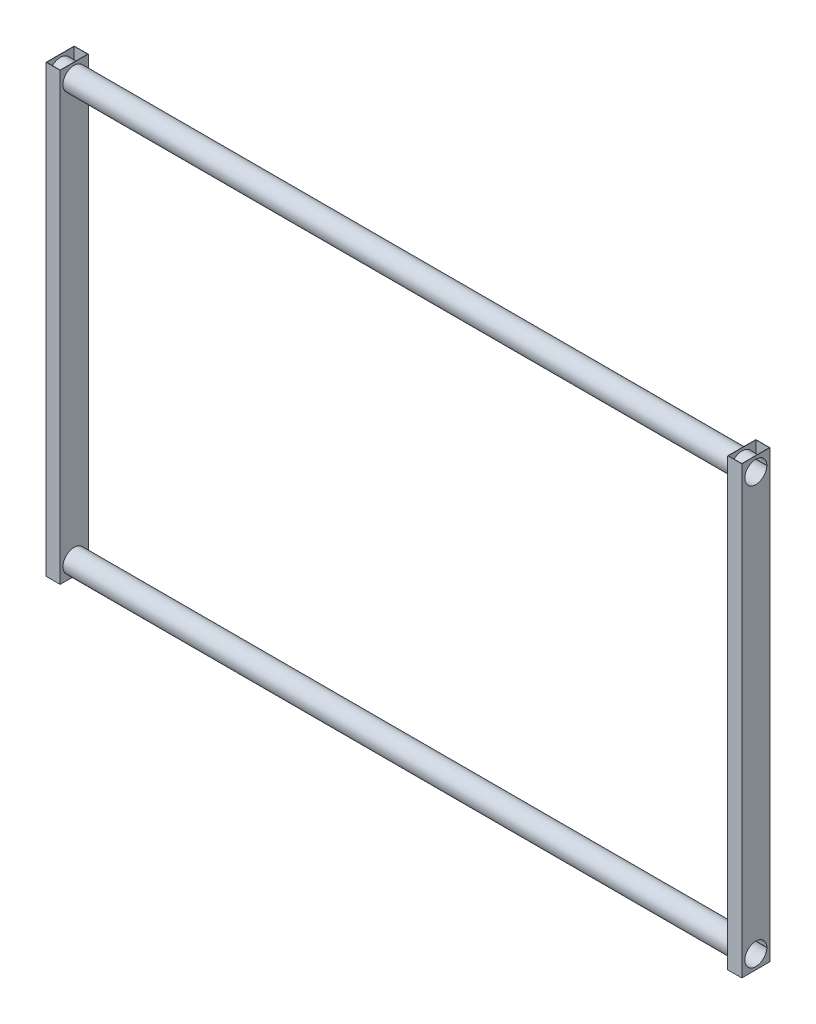
ISO-10303-21;
HEADER;
FILE_DESCRIPTION(('STEP AP214'),'2;1');
FILE_NAME('part.step','',(''),(''),'','','');
FILE_SCHEMA(('AUTOMOTIVE_DESIGN { 1 0 10303 214 1 1 1 1 }'));
ENDSEC;
DATA;
#1=APPLICATION_CONTEXT('core data for automotive mechanical design processes');
#2=APPLICATION_PROTOCOL_DEFINITION('international standard','automotive_design',2000,#1);
#3=PRODUCT_CONTEXT('',#1,'mechanical');
#4=PRODUCT('Part','Part','',(#3));
#5=PRODUCT_RELATED_PRODUCT_CATEGORY('part','',(#4));
#6=PRODUCT_DEFINITION_FORMATION('','',#4);
#7=PRODUCT_DEFINITION_CONTEXT('part definition',#1,'design');
#8=PRODUCT_DEFINITION('design','',#6,#7);
#9=PRODUCT_DEFINITION_SHAPE('','',#8);
#10=(LENGTH_UNIT() NAMED_UNIT(*) SI_UNIT(.MILLI.,.METRE.));
#11=(NAMED_UNIT(*) PLANE_ANGLE_UNIT() SI_UNIT($,.RADIAN.));
#12=(NAMED_UNIT(*) SI_UNIT($,.STERADIAN.) SOLID_ANGLE_UNIT());
#13=UNCERTAINTY_MEASURE_WITH_UNIT(LENGTH_MEASURE(1.E-05),#10,'distance_accuracy_value','');
#14=(GEOMETRIC_REPRESENTATION_CONTEXT(3) GLOBAL_UNCERTAINTY_ASSIGNED_CONTEXT((#13)) GLOBAL_UNIT_ASSIGNED_CONTEXT((#10,
#11,#12)) REPRESENTATION_CONTEXT('',''));
#15=CARTESIAN_POINT('',(0.,0.,0.));
#16=DIRECTION('',(0.,0.,1.));
#17=DIRECTION('',(1.,0.,0.));
#18=AXIS2_PLACEMENT_3D('',#15,#16,#17);
#19=CARTESIAN_POINT('',(2448.5,1600.,-49.5000000000003));
#20=DIRECTION('',(-1.,0.,0.));
#21=DIRECTION('',(0.,0.,1.));
#22=AXIS2_PLACEMENT_3D('',#19,#20,#21);
#23=PLANE('',#22);
#24=DIRECTION('',(0.,0.,-1.));
#25=VECTOR('',#24,1.);
#26=CARTESIAN_POINT('',(2448.5,0.,-49.5000000000003));
#27=LINE('',#26,#25);
#28=CARTESIAN_POINT('',(2448.5,0.,49.5000000000003));
#29=VERTEX_POINT('',#28);
#30=CARTESIAN_POINT('',(2448.5,0.,-49.5000000000003));
#31=VERTEX_POINT('',#30);
#32=EDGE_CURVE('E502',#29,#31,#27,.T.);
#33=ORIENTED_EDGE('',*,*,#32,.F.);
#34=DIRECTION('',(0.,-1.,0.));
#35=VECTOR('',#34,1.);
#36=CARTESIAN_POINT('',(2448.5,1600.,49.5000000000003));
#37=LINE('',#36,#35);
#38=CARTESIAN_POINT('',(2448.5,1600.,49.5000000000003));
#39=VERTEX_POINT('',#38);
#40=EDGE_CURVE('E521',#39,#29,#37,.T.);
#41=ORIENTED_EDGE('',*,*,#40,.F.);
#42=DIRECTION('',(0.,0.,-1.));
#43=VECTOR('',#42,1.);
#44=CARTESIAN_POINT('',(2448.5,1600.,-49.5000000000003));
#45=LINE('',#44,#43);
#46=CARTESIAN_POINT('',(2448.5,1600.,-49.5000000000003));
#47=VERTEX_POINT('',#46);
#48=EDGE_CURVE('E487',#39,#47,#45,.T.);
#49=ORIENTED_EDGE('',*,*,#48,.T.);
#50=DIRECTION('',(0.,-1.,0.));
#51=VECTOR('',#50,1.);
#52=CARTESIAN_POINT('',(2448.5,1600.,-49.5000000000003));
#53=LINE('',#52,#51);
#54=EDGE_CURVE('E518',#47,#31,#53,.T.);
#55=ORIENTED_EDGE('',*,*,#54,.T.);
#56=EDGE_LOOP('',(#33,#41,#49,#55));
#57=FACE_BOUND('',#56,.T.);
#58=CARTESIAN_POINT('',(2448.5,50.,0.));
#59=DIRECTION('',(-1.,0.,0.));
#60=DIRECTION('',(0.,0.,1.));
#61=AXIS2_PLACEMENT_3D('',#58,#59,#60);
#62=CIRCLE('',#61,39.5);
#63=CARTESIAN_POINT('',(2448.5,49.5,-39.496835316263));
#64=VERTEX_POINT('',#63);
#65=CARTESIAN_POINT('',(2448.5,50.5,-39.496835316263));
#66=VERTEX_POINT('',#65);
#67=EDGE_CURVE('E478',#64,#66,#62,.F.);
#68=ORIENTED_EDGE('',*,*,#67,.T.);
#69=DIRECTION('',(0.,0.,1.));
#70=VECTOR('',#69,1.);
#71=CARTESIAN_POINT('',(2448.5,50.5,-39.496835316263));
#72=LINE('',#71,#70);
#73=CARTESIAN_POINT('',(2448.5,50.5,-40.4969134626332));
#74=VERTEX_POINT('',#73);
#75=EDGE_CURVE('E429',#74,#66,#72,.T.);
#76=ORIENTED_EDGE('',*,*,#75,.F.);
#77=CARTESIAN_POINT('',(2448.5,50.,0.));
#78=DIRECTION('',(-1.,0.,0.));
#79=DIRECTION('',(0.,0.,1.));
#80=AXIS2_PLACEMENT_3D('',#77,#78,#79);
#81=CIRCLE('',#80,40.5);
#82=CARTESIAN_POINT('',(2448.5,49.5000000000001,-40.4969134626332));
#83=VERTEX_POINT('',#82);
#84=EDGE_CURVE('E425',#83,#74,#81,.T.);
#85=ORIENTED_EDGE('',*,*,#84,.F.);
#86=DIRECTION('',(0.,0.,-1.));
#87=VECTOR('',#86,1.);
#88=CARTESIAN_POINT('',(2448.5,49.5,-39.496835316263));
#89=LINE('',#88,#87);
#90=EDGE_CURVE('E411',#64,#83,#89,.T.);
#91=ORIENTED_EDGE('',*,*,#90,.F.);
#92=EDGE_LOOP('',(#68,#76,#85,#91));
#93=FACE_BOUND('',#92,.T.);
#94=CARTESIAN_POINT('',(2448.5,1550.,0.));
#95=DIRECTION('',(-1.,0.,0.));
#96=DIRECTION('',(0.,0.,1.));
#97=AXIS2_PLACEMENT_3D('',#94,#95,#96);
#98=CIRCLE('',#97,39.5);
#99=CARTESIAN_POINT('',(2448.5,1549.5,-39.496835316263));
#100=VERTEX_POINT('',#99);
#101=CARTESIAN_POINT('',(2448.5,1550.5,-39.496835316263));
#102=VERTEX_POINT('',#101);
#103=EDGE_CURVE('E250',#100,#102,#98,.F.);
#104=ORIENTED_EDGE('',*,*,#103,.T.);
#105=DIRECTION('',(0.,0.,1.));
#106=VECTOR('',#105,1.);
#107=CARTESIAN_POINT('',(2448.5,1550.5,-40.4969134626332));
#108=LINE('',#107,#106);
#109=CARTESIAN_POINT('',(2448.5,1550.5,-40.4969134626332));
#110=VERTEX_POINT('',#109);
#111=EDGE_CURVE('E56',#110,#102,#108,.T.);
#112=ORIENTED_EDGE('',*,*,#111,.F.);
#113=CARTESIAN_POINT('',(2448.5,1550.,0.));
#114=DIRECTION('',(-1.,0.,0.));
#115=DIRECTION('',(0.,0.,-1.));
#116=AXIS2_PLACEMENT_3D('',#113,#114,#115);
#117=CIRCLE('',#116,40.5);
#118=CARTESIAN_POINT('',(2448.5,1549.5,-40.4969134626332));
#119=VERTEX_POINT('',#118);
#120=EDGE_CURVE('E61',#119,#110,#117,.T.);
#121=ORIENTED_EDGE('',*,*,#120,.F.);
#122=DIRECTION('',(0.,0.,-1.));
#123=VECTOR('',#122,1.);
#124=CARTESIAN_POINT('',(2448.5,1549.5,-40.4969134626332));
#125=LINE('',#124,#123);
#126=EDGE_CURVE('E263',#100,#119,#125,.T.);
#127=ORIENTED_EDGE('',*,*,#126,.F.);
#128=EDGE_LOOP('',(#104,#112,#121,#127));
#129=FACE_BOUND('',#128,.T.);
#130=ADVANCED_FACE('F40',(#57,#93,#129),#23,.T.);
#131=CARTESIAN_POINT('',(-115.55129855222,1550.,0.));
#132=DIRECTION('',(1.,0.,0.));
#133=DIRECTION('',(0.,0.,-1.));
#134=AXIS2_PLACEMENT_3D('',#131,#132,#133);
#135=CYLINDRICAL_SURFACE('',#134,40.5);
#136=DIRECTION('',(1.,0.,0.));
#137=VECTOR('',#136,1.);
#138=CARTESIAN_POINT('',(-164.04911606151,1550.5,-40.4969134626332));
#139=LINE('',#138,#137);
#140=CARTESIAN_POINT('',(2399.,1550.5,-40.4969134626332));
#141=VERTEX_POINT('',#140);
#142=CARTESIAN_POINT('',(2400.,1550.5,-40.4969134626332));
#143=VERTEX_POINT('',#142);
#144=EDGE_CURVE('E610',#141,#143,#139,.T.);
#145=ORIENTED_EDGE('',*,*,#144,.F.);
#146=CARTESIAN_POINT('',(2399.,1550.,0.));
#147=DIRECTION('',(1.,0.,0.));
#148=DIRECTION('',(0.,0.,-1.));
#149=AXIS2_PLACEMENT_3D('',#146,#147,#148);
#150=CIRCLE('',#149,40.5);
#151=CARTESIAN_POINT('',(2399.,1549.5,-40.4969134626332));
#152=VERTEX_POINT('',#151);
#153=EDGE_CURVE('E461',#152,#141,#150,.T.);
#154=ORIENTED_EDGE('',*,*,#153,.F.);
#155=DIRECTION('',(1.,0.,0.));
#156=VECTOR('',#155,1.);
#157=CARTESIAN_POINT('',(-164.04911606151,1549.5,-40.4969134626332));
#158=LINE('',#157,#156);
#159=CARTESIAN_POINT('',(2400.,1549.5,-40.4969134626332));
#160=VERTEX_POINT('',#159);
#161=EDGE_CURVE('E607',#152,#160,#158,.T.);
#162=ORIENTED_EDGE('',*,*,#161,.T.);
#163=CARTESIAN_POINT('',(2400.,1550.,0.));
#164=DIRECTION('',(1.,0.,0.));
#165=DIRECTION('',(0.,0.,-1.));
#166=AXIS2_PLACEMENT_3D('',#163,#164,#165);
#167=CIRCLE('',#166,40.5);
#168=EDGE_CURVE('E421',#160,#143,#167,.T.);
#169=ORIENTED_EDGE('',*,*,#168,.T.);
#170=EDGE_LOOP('',(#145,#154,#162,#169));
#171=FACE_BOUND('',#170,.T.);
#172=ADVANCED_FACE('F619',(#171),#135,.F.);
#173=CARTESIAN_POINT('',(-49.5,1600.,-49.5));
#174=DIRECTION('',(1.,0.,0.));
#175=DIRECTION('',(0.,0.,-1.));
#176=AXIS2_PLACEMENT_3D('',#173,#174,#175);
#177=PLANE('',#176);
#178=DIRECTION('',(0.,0.,1.));
#179=VECTOR('',#178,1.);
#180=CARTESIAN_POINT('',(-49.5,0.,-49.5));
#181=LINE('',#180,#179);
#182=CARTESIAN_POINT('',(-49.5,0.,-49.5));
#183=VERTEX_POINT('',#182);
#184=CARTESIAN_POINT('',(-49.5,0.,49.5));
#185=VERTEX_POINT('',#184);
#186=EDGE_CURVE('E345',#183,#185,#181,.T.);
#187=ORIENTED_EDGE('',*,*,#186,.F.);
#188=DIRECTION('',(0.,-1.,0.));
#189=VECTOR('',#188,1.);
#190=CARTESIAN_POINT('',(-49.5,1600.,-49.5));
#191=LINE('',#190,#189);
#192=CARTESIAN_POINT('',(-49.5,1600.,-49.5));
#193=VERTEX_POINT('',#192);
#194=EDGE_CURVE('E358',#193,#183,#191,.T.);
#195=ORIENTED_EDGE('',*,*,#194,.F.);
#196=DIRECTION('',(0.,0.,1.));
#197=VECTOR('',#196,1.);
#198=CARTESIAN_POINT('',(-49.5,1600.,-49.5));
#199=LINE('',#198,#197);
#200=CARTESIAN_POINT('',(-49.5,1600.,49.5));
#201=VERTEX_POINT('',#200);
#202=EDGE_CURVE('E330',#193,#201,#199,.T.);
#203=ORIENTED_EDGE('',*,*,#202,.T.);
#204=DIRECTION('',(0.,-1.,0.));
#205=VECTOR('',#204,1.);
#206=CARTESIAN_POINT('',(-49.5,1600.,49.5));
#207=LINE('',#206,#205);
#208=EDGE_CURVE('E355',#201,#185,#207,.T.);
#209=ORIENTED_EDGE('',*,*,#208,.T.);
#210=EDGE_LOOP('',(#187,#195,#203,#209));
#211=FACE_BOUND('',#210,.T.);
#212=DIRECTION('',(0.,0.,-1.));
#213=VECTOR('',#212,1.);
#214=CARTESIAN_POINT('',(-49.5,50.5,-39.496835316263));
#215=LINE('',#214,#213);
#216=CARTESIAN_POINT('',(-49.5,50.5,-39.496835316263));
#217=VERTEX_POINT('',#216);
#218=CARTESIAN_POINT('',(-49.5,50.5,-40.4969134626332));
#219=VERTEX_POINT('',#218);
#220=EDGE_CURVE('E417',#217,#219,#215,.T.);
#221=ORIENTED_EDGE('',*,*,#220,.F.);
#222=CARTESIAN_POINT('',(-49.5,50.,0.));
#223=DIRECTION('',(1.,0.,0.));
#224=DIRECTION('',(0.,0.,-1.));
#225=AXIS2_PLACEMENT_3D('',#222,#223,#224);
#226=CIRCLE('',#225,39.5);
#227=CARTESIAN_POINT('',(-49.5,49.5,-39.496835316263));
#228=VERTEX_POINT('',#227);
#229=EDGE_CURVE('E313',#217,#228,#226,.F.);
#230=ORIENTED_EDGE('',*,*,#229,.T.);
#231=DIRECTION('',(0.,0.,1.));
#232=VECTOR('',#231,1.);
#233=CARTESIAN_POINT('',(-49.5,49.5,-39.496835316263));
#234=LINE('',#233,#232);
#235=CARTESIAN_POINT('',(-49.5,49.5,-40.4969134626332));
#236=VERTEX_POINT('',#235);
#237=EDGE_CURVE('E416',#236,#228,#234,.T.);
#238=ORIENTED_EDGE('',*,*,#237,.F.);
#239=CARTESIAN_POINT('',(-49.5,50.,0.));
#240=DIRECTION('',(1.,0.,0.));
#241=DIRECTION('',(0.,0.,-1.));
#242=AXIS2_PLACEMENT_3D('',#239,#240,#241);
#243=CIRCLE('',#242,40.5);
#244=EDGE_CURVE('E412',#219,#236,#243,.T.);
#245=ORIENTED_EDGE('',*,*,#244,.F.);
#246=EDGE_LOOP('',(#221,#230,#238,#245));
#247=FACE_BOUND('',#246,.T.);
#248=CARTESIAN_POINT('',(-49.5,1550.,0.));
#249=DIRECTION('',(1.,0.,0.));
#250=DIRECTION('',(0.,0.,-1.));
#251=AXIS2_PLACEMENT_3D('',#248,#249,#250);
#252=CIRCLE('',#251,40.5);
#253=CARTESIAN_POINT('',(-49.5,1550.5,-40.4969134626332));
#254=VERTEX_POINT('',#253);
#255=CARTESIAN_POINT('',(-49.5,1549.5,-40.4969134626332));
#256=VERTEX_POINT('',#255);
#257=EDGE_CURVE('E279',#254,#256,#252,.T.);
#258=ORIENTED_EDGE('',*,*,#257,.F.);
#259=DIRECTION('',(0.,0.,-1.));
#260=VECTOR('',#259,1.);
#261=CARTESIAN_POINT('',(-49.5,1550.5,-40.4969134626332));
#262=LINE('',#261,#260);
#263=CARTESIAN_POINT('',(-49.5,1550.5,-39.496835316263));
#264=VERTEX_POINT('',#263);
#265=EDGE_CURVE('E272',#264,#254,#262,.T.);
#266=ORIENTED_EDGE('',*,*,#265,.F.);
#267=CARTESIAN_POINT('',(-49.5,1550.,0.));
#268=DIRECTION('',(1.,0.,0.));
#269=DIRECTION('',(0.,0.,-1.));
#270=AXIS2_PLACEMENT_3D('',#267,#268,#269);
#271=CIRCLE('',#270,39.5);
#272=CARTESIAN_POINT('',(-49.5,1549.5,-39.4968353162629));
#273=VERTEX_POINT('',#272);
#274=EDGE_CURVE('E314',#264,#273,#271,.F.);
#275=ORIENTED_EDGE('',*,*,#274,.T.);
#276=DIRECTION('',(0.,0.,1.));
#277=VECTOR('',#276,1.);
#278=CARTESIAN_POINT('',(-49.5,1549.5,-40.4969134626332));
#279=LINE('',#278,#277);
#280=EDGE_CURVE('E270',#256,#273,#279,.T.);
#281=ORIENTED_EDGE('',*,*,#280,.F.);
#282=EDGE_LOOP('',(#258,#266,#275,#281));
#283=FACE_BOUND('',#282,.T.);
#284=ADVANCED_FACE('F652',(#211,#247,#283),#177,.T.);
#285=CARTESIAN_POINT('',(-115.55129855222,1550.,0.));
#286=DIRECTION('',(1.,0.,0.));
#287=DIRECTION('',(0.,0.,-1.));
#288=AXIS2_PLACEMENT_3D('',#285,#286,#287);
#289=CYLINDRICAL_SURFACE('',#288,40.5);
#290=DIRECTION('',(1.,0.,0.));
#291=VECTOR('',#290,1.);
#292=CARTESIAN_POINT('',(-115.55129855222,1550.5,-40.4969134626332));
#293=LINE('',#292,#291);
#294=CARTESIAN_POINT('',(-1.00000000000001,1550.5,-40.4969134626332));
#295=VERTEX_POINT('',#294);
#296=CARTESIAN_POINT('',(0.,1550.5,-40.4969134626332));
#297=VERTEX_POINT('',#296);
#298=EDGE_CURVE('E11',#295,#297,#293,.T.);
#299=ORIENTED_EDGE('',*,*,#298,.F.);
#300=CARTESIAN_POINT('',(-1.00000000000001,1550.,0.));
#301=DIRECTION('',(-1.,0.,0.));
#302=DIRECTION('',(0.,0.,1.));
#303=AXIS2_PLACEMENT_3D('',#300,#301,#302);
#304=CIRCLE('',#303,40.5);
#305=CARTESIAN_POINT('',(-1.,1549.5,-40.4969134626332));
#306=VERTEX_POINT('',#305);
#307=EDGE_CURVE('E294',#306,#295,#304,.F.);
#308=ORIENTED_EDGE('',*,*,#307,.F.);
#309=DIRECTION('',(1.,0.,0.));
#310=VECTOR('',#309,1.);
#311=CARTESIAN_POINT('',(-115.55129855222,1549.5,-40.4969134626332));
#312=LINE('',#311,#310);
#313=CARTESIAN_POINT('',(0.,1549.5,-40.4969134626332));
#314=VERTEX_POINT('',#313);
#315=EDGE_CURVE('E49',#314,#306,#312,.F.);
#316=ORIENTED_EDGE('',*,*,#315,.F.);
#317=CARTESIAN_POINT('',(0.,1550.,0.));
#318=DIRECTION('',(-1.,0.,0.));
#319=DIRECTION('',(0.,0.,1.));
#320=AXIS2_PLACEMENT_3D('',#317,#318,#319);
#321=CIRCLE('',#320,40.5);
#322=EDGE_CURVE('E299',#297,#314,#321,.T.);
#323=ORIENTED_EDGE('',*,*,#322,.F.);
#324=EDGE_LOOP('',(#299,#308,#316,#323));
#325=FACE_BOUND('',#324,.T.);
#326=ADVANCED_FACE('F773',(#325),#289,.F.);
#327=CARTESIAN_POINT('',(-164.04911606151,50.,0.));
#328=DIRECTION('',(1.,0.,0.));
#329=DIRECTION('',(0.,0.,-1.));
#330=AXIS2_PLACEMENT_3D('',#327,#328,#329);
#331=CYLINDRICAL_SURFACE('',#330,40.5);
#332=CARTESIAN_POINT('',(0.,50.,0.));
#333=DIRECTION('',(-1.,0.,0.));
#334=DIRECTION('',(0.,0.,1.));
#335=AXIS2_PLACEMENT_3D('',#332,#333,#334);
#336=CIRCLE('',#335,40.5);
#337=CARTESIAN_POINT('',(0.,49.5,-40.4969134626332));
#338=VERTEX_POINT('',#337);
#339=CARTESIAN_POINT('',(0.,50.5,-40.4969134626332));
#340=VERTEX_POINT('',#339);
#341=EDGE_CURVE('E303',#338,#340,#336,.T.);
#342=ORIENTED_EDGE('',*,*,#341,.F.);
#343=DIRECTION('',(1.,0.,0.));
#344=VECTOR('',#343,1.);
#345=CARTESIAN_POINT('',(-164.04911606151,49.5,-40.4969134626332));
#346=LINE('',#345,#344);
#347=CARTESIAN_POINT('',(2399.,49.5,-40.4969134626332));
#348=VERTEX_POINT('',#347);
#349=EDGE_CURVE('E450',#338,#348,#346,.T.);
#350=ORIENTED_EDGE('',*,*,#349,.T.);
#351=CARTESIAN_POINT('',(2399.,50.,0.));
#352=DIRECTION('',(1.,0.,0.));
#353=DIRECTION('',(0.,0.,-1.));
#354=AXIS2_PLACEMENT_3D('',#351,#352,#353);
#355=CIRCLE('',#354,40.5);
#356=CARTESIAN_POINT('',(2399.,50.5,-40.4969134626332));
#357=VERTEX_POINT('',#356);
#358=EDGE_CURVE('E471',#357,#348,#355,.T.);
#359=ORIENTED_EDGE('',*,*,#358,.F.);
#360=DIRECTION('',(1.,0.,0.));
#361=VECTOR('',#360,1.);
#362=CARTESIAN_POINT('',(-164.04911606151,50.5,-40.4969134626332));
#363=LINE('',#362,#361);
#364=EDGE_CURVE('E443',#340,#357,#363,.T.);
#365=ORIENTED_EDGE('',*,*,#364,.F.);
#366=EDGE_LOOP('',(#342,#350,#359,#365));
#367=FACE_BOUND('',#366,.T.);
#368=ADVANCED_FACE('F724',(#367),#331,.T.);
#369=CARTESIAN_POINT('',(-115.55129855222,50.,0.));
#370=DIRECTION('',(1.,0.,0.));
#371=DIRECTION('',(0.,0.,-1.));
#372=AXIS2_PLACEMENT_3D('',#369,#370,#371);
#373=CYLINDRICAL_SURFACE('',#372,40.5);
#374=DIRECTION('',(1.,0.,0.));
#375=VECTOR('',#374,1.);
#376=CARTESIAN_POINT('',(-115.55129855222,50.5,-40.4969134626332));
#377=LINE('',#376,#375);
#378=CARTESIAN_POINT('',(2400.,50.5,-40.4969134626332));
#379=VERTEX_POINT('',#378);
#380=EDGE_CURVE('E571',#357,#379,#377,.T.);
#381=ORIENTED_EDGE('',*,*,#380,.F.);
#382=EDGE_CURVE('E470',#348,#357,#355,.T.);
#383=ORIENTED_EDGE('',*,*,#382,.F.);
#384=DIRECTION('',(1.,0.,0.));
#385=VECTOR('',#384,1.);
#386=CARTESIAN_POINT('',(-115.55129855222,49.5,-40.4969134626332));
#387=LINE('',#386,#385);
#388=CARTESIAN_POINT('',(2400.,49.5,-40.4969134626332));
#389=VERTEX_POINT('',#388);
#390=EDGE_CURVE('E567',#389,#348,#387,.F.);
#391=ORIENTED_EDGE('',*,*,#390,.F.);
#392=CARTESIAN_POINT('',(2400.,50.,0.));
#393=DIRECTION('',(1.,0.,0.));
#394=DIRECTION('',(0.,0.,-1.));
#395=AXIS2_PLACEMENT_3D('',#392,#393,#394);
#396=CIRCLE('',#395,40.5);
#397=EDGE_CURVE('E462',#389,#379,#396,.T.);
#398=ORIENTED_EDGE('',*,*,#397,.T.);
#399=EDGE_LOOP('',(#381,#383,#391,#398));
#400=FACE_BOUND('',#399,.T.);
#401=ADVANCED_FACE('F668',(#400),#373,.F.);
#402=CARTESIAN_POINT('',(0.,1600.,0.));
#403=DIRECTION('',(0.,1.,0.));
#404=DIRECTION('',(0.,0.,1.));
#405=AXIS2_PLACEMENT_3D('',#402,#403,#404);
#406=PLANE('',#405);
#407=DIRECTION('',(0.,0.,1.));
#408=VECTOR('',#407,1.);
#409=CARTESIAN_POINT('',(2399.,1600.,-50.4999999999997));
#410=LINE('',#409,#408);
#411=CARTESIAN_POINT('',(2399.,1600.,-50.4999999999997));
#412=VERTEX_POINT('',#411);
#413=CARTESIAN_POINT('',(2399.,1600.,50.4999999999997));
#414=VERTEX_POINT('',#413);
#415=EDGE_CURVE('E526',#412,#414,#410,.T.);
#416=ORIENTED_EDGE('',*,*,#415,.T.);
#417=DIRECTION('',(1.,0.,0.));
#418=VECTOR('',#417,1.);
#419=CARTESIAN_POINT('',(2399.,1600.,50.4999999999997));
#420=LINE('',#419,#418);
#421=CARTESIAN_POINT('',(2449.5,1600.,50.4999999999997));
#422=VERTEX_POINT('',#421);
#423=EDGE_CURVE('E530',#414,#422,#420,.T.);
#424=ORIENTED_EDGE('',*,*,#423,.T.);
#425=DIRECTION('',(0.,0.,-1.));
#426=VECTOR('',#425,1.);
#427=CARTESIAN_POINT('',(2449.5,1600.,-50.4999999999997));
#428=LINE('',#427,#426);
#429=CARTESIAN_POINT('',(2449.5,1600.,-50.4999999999997));
#430=VERTEX_POINT('',#429);
#431=EDGE_CURVE('E534',#422,#430,#428,.T.);
#432=ORIENTED_EDGE('',*,*,#431,.T.);
#433=DIRECTION('',(-1.,0.,0.));
#434=VECTOR('',#433,1.);
#435=CARTESIAN_POINT('',(2399.,1600.,-50.4999999999997));
#436=LINE('',#435,#434);
#437=EDGE_CURVE('E537',#430,#412,#436,.T.);
#438=ORIENTED_EDGE('',*,*,#437,.T.);
#439=EDGE_LOOP('',(#416,#424,#432,#438));
#440=FACE_BOUND('',#439,.T.);
#441=ORIENTED_EDGE('',*,*,#48,.F.);
#442=DIRECTION('',(1.,0.,0.));
#443=VECTOR('',#442,1.);
#444=CARTESIAN_POINT('',(2400.,1600.,49.5000000000003));
#445=LINE('',#444,#443);
#446=CARTESIAN_POINT('',(2400.,1600.,49.5000000000003));
#447=VERTEX_POINT('',#446);
#448=EDGE_CURVE('E484',#447,#39,#445,.T.);
#449=ORIENTED_EDGE('',*,*,#448,.F.);
#450=DIRECTION('',(0.,0.,1.));
#451=VECTOR('',#450,1.);
#452=CARTESIAN_POINT('',(2400.,1600.,-49.5000000000003));
#453=LINE('',#452,#451);
#454=CARTESIAN_POINT('',(2400.,1600.,-49.5000000000003));
#455=VERTEX_POINT('',#454);
#456=EDGE_CURVE('E495',#455,#447,#453,.T.);
#457=ORIENTED_EDGE('',*,*,#456,.F.);
#458=DIRECTION('',(-1.,0.,0.));
#459=VECTOR('',#458,1.);
#460=CARTESIAN_POINT('',(2400.,1600.,-49.5000000000003));
#461=LINE('',#460,#459);
#462=EDGE_CURVE('E491',#47,#455,#461,.T.);
#463=ORIENTED_EDGE('',*,*,#462,.F.);
#464=EDGE_LOOP('',(#441,#449,#457,#463));
#465=FACE_BOUND('',#464,.T.);
#466=ADVANCED_FACE('F664',(#440,#465),#406,.T.);
#467=CARTESIAN_POINT('',(0.,0.,0.));
#468=DIRECTION('',(0.,1.,0.));
#469=DIRECTION('',(0.,0.,1.));
#470=AXIS2_PLACEMENT_3D('',#467,#468,#469);
#471=PLANE('',#470);
#472=DIRECTION('',(0.,0.,1.));
#473=VECTOR('',#472,1.);
#474=CARTESIAN_POINT('',(2399.,0.,-50.4999999999997));
#475=LINE('',#474,#473);
#476=CARTESIAN_POINT('',(2399.,0.,-50.4999999999997));
#477=VERTEX_POINT('',#476);
#478=CARTESIAN_POINT('',(2399.,0.,50.4999999999997));
#479=VERTEX_POINT('',#478);
#480=EDGE_CURVE('E525',#477,#479,#475,.T.);
#481=ORIENTED_EDGE('',*,*,#480,.F.);
#482=DIRECTION('',(-1.,0.,0.));
#483=VECTOR('',#482,1.);
#484=CARTESIAN_POINT('',(2399.,0.,-50.4999999999997));
#485=LINE('',#484,#483);
#486=CARTESIAN_POINT('',(2449.5,0.,-50.4999999999997));
#487=VERTEX_POINT('',#486);
#488=EDGE_CURVE('E531',#487,#477,#485,.T.);
#489=ORIENTED_EDGE('',*,*,#488,.F.);
#490=DIRECTION('',(0.,0.,-1.));
#491=VECTOR('',#490,1.);
#492=CARTESIAN_POINT('',(2449.5,0.,-50.4999999999997));
#493=LINE('',#492,#491);
#494=CARTESIAN_POINT('',(2449.5,0.,50.4999999999997));
#495=VERTEX_POINT('',#494);
#496=EDGE_CURVE('E547',#495,#487,#493,.T.);
#497=ORIENTED_EDGE('',*,*,#496,.F.);
#498=DIRECTION('',(1.,0.,0.));
#499=VECTOR('',#498,1.);
#500=CARTESIAN_POINT('',(2399.,0.,50.4999999999997));
#501=LINE('',#500,#499);
#502=EDGE_CURVE('E544',#479,#495,#501,.T.);
#503=ORIENTED_EDGE('',*,*,#502,.F.);
#504=EDGE_LOOP('',(#481,#489,#497,#503));
#505=FACE_BOUND('',#504,.T.);
#506=DIRECTION('',(1.,0.,0.));
#507=VECTOR('',#506,1.);
#508=CARTESIAN_POINT('',(2400.,0.,49.5000000000003));
#509=LINE('',#508,#507);
#510=CARTESIAN_POINT('',(2400.,0.,49.5000000000003));
#511=VERTEX_POINT('',#510);
#512=EDGE_CURVE('E480',#511,#29,#509,.T.);
#513=ORIENTED_EDGE('',*,*,#512,.T.);
#514=ORIENTED_EDGE('',*,*,#32,.T.);
#515=DIRECTION('',(-1.,0.,0.));
#516=VECTOR('',#515,1.);
#517=CARTESIAN_POINT('',(2400.,0.,-49.5000000000003));
#518=LINE('',#517,#516);
#519=CARTESIAN_POINT('',(2400.,0.,-49.5000000000003));
#520=VERTEX_POINT('',#519);
#521=EDGE_CURVE('E506',#31,#520,#518,.T.);
#522=ORIENTED_EDGE('',*,*,#521,.T.);
#523=DIRECTION('',(0.,0.,1.));
#524=VECTOR('',#523,1.);
#525=CARTESIAN_POINT('',(2400.,0.,-49.5000000000003));
#526=LINE('',#525,#524);
#527=EDGE_CURVE('E488',#520,#511,#526,.T.);
#528=ORIENTED_EDGE('',*,*,#527,.T.);
#529=EDGE_LOOP('',(#513,#514,#522,#528));
#530=FACE_BOUND('',#529,.T.);
#531=ADVANCED_FACE('F667',(#505,#530),#471,.F.);
#532=CARTESIAN_POINT('',(2399.,1600.,-50.4999999999997));
#533=DIRECTION('',(1.,0.,0.));
#534=DIRECTION('',(0.,0.,-1.));
#535=AXIS2_PLACEMENT_3D('',#532,#533,#534);
#536=PLANE('',#535);
#537=ORIENTED_EDGE('',*,*,#358,.T.);
#538=ORIENTED_EDGE('',*,*,#382,.T.);
#539=EDGE_LOOP('',(#537,#538));
#540=FACE_BOUND('',#539,.T.);
#541=EDGE_CURVE('E467',#141,#152,#150,.T.);
#542=ORIENTED_EDGE('',*,*,#541,.T.);
#543=ORIENTED_EDGE('',*,*,#153,.T.);
#544=EDGE_LOOP('',(#542,#543));
#545=FACE_BOUND('',#544,.T.);
#546=ORIENTED_EDGE('',*,*,#480,.T.);
#547=DIRECTION('',(0.,-1.,0.));
#548=VECTOR('',#547,1.);
#549=CARTESIAN_POINT('',(2399.,1600.,50.4999999999997));
#550=LINE('',#549,#548);
#551=EDGE_CURVE('E563',#414,#479,#550,.T.);
#552=ORIENTED_EDGE('',*,*,#551,.F.);
#553=ORIENTED_EDGE('',*,*,#415,.F.);
#554=DIRECTION('',(0.,-1.,0.));
#555=VECTOR('',#554,1.);
#556=CARTESIAN_POINT('',(2399.,1600.,-50.4999999999997));
#557=LINE('',#556,#555);
#558=EDGE_CURVE('E540',#412,#477,#557,.T.);
#559=ORIENTED_EDGE('',*,*,#558,.T.);
#560=EDGE_LOOP('',(#546,#552,#553,#559));
#561=FACE_BOUND('',#560,.T.);
#562=ADVANCED_FACE('F42',(#540,#545,#561),#536,.F.);
#563=CARTESIAN_POINT('',(2399.,1600.,50.4999999999997));
#564=DIRECTION('',(0.,0.,-1.));
#565=DIRECTION('',(-1.,0.,0.));
#566=AXIS2_PLACEMENT_3D('',#563,#564,#565);
#567=PLANE('',#566);
#568=ORIENTED_EDGE('',*,*,#502,.T.);
#569=DIRECTION('',(0.,-1.,0.));
#570=VECTOR('',#569,1.);
#571=CARTESIAN_POINT('',(2449.5,1600.,50.4999999999997));
#572=LINE('',#571,#570);
#573=EDGE_CURVE('E559',#422,#495,#572,.T.);
#574=ORIENTED_EDGE('',*,*,#573,.F.);
#575=ORIENTED_EDGE('',*,*,#423,.F.);
#576=ORIENTED_EDGE('',*,*,#551,.T.);
#577=EDGE_LOOP('',(#568,#574,#575,#576));
#578=FACE_BOUND('',#577,.T.);
#579=ADVANCED_FACE('F678',(#578),#567,.F.);
#580=CARTESIAN_POINT('',(2449.5,1600.,-50.4999999999997));
#581=DIRECTION('',(-1.,0.,0.));
#582=DIRECTION('',(0.,0.,1.));
#583=AXIS2_PLACEMENT_3D('',#580,#581,#582);
#584=PLANE('',#583);
#585=CARTESIAN_POINT('',(2449.5,50.,0.));
#586=DIRECTION('',(1.,0.,0.));
#587=DIRECTION('',(0.,0.,-1.));
#588=AXIS2_PLACEMENT_3D('',#585,#586,#587);
#589=CIRCLE('',#588,39.5);
#590=CARTESIAN_POINT('',(2449.5,50.,-39.5));
#591=VERTEX_POINT('',#590);
#592=EDGE_CURVE('E259',#591,#591,#589,.T.);
#593=ORIENTED_EDGE('',*,*,#592,.F.);
#594=EDGE_LOOP('',(#593));
#595=FACE_BOUND('',#594,.T.);
#596=CARTESIAN_POINT('',(2449.5,1550.,0.));
#597=DIRECTION('',(1.,0.,0.));
#598=DIRECTION('',(0.,0.,-1.));
#599=AXIS2_PLACEMENT_3D('',#596,#597,#598);
#600=CIRCLE('',#599,39.5);
#601=CARTESIAN_POINT('',(2449.5,1550.,-39.5));
#602=VERTEX_POINT('',#601);
#603=EDGE_CURVE('E260',#602,#602,#600,.T.);
#604=ORIENTED_EDGE('',*,*,#603,.F.);
#605=EDGE_LOOP('',(#604));
#606=FACE_BOUND('',#605,.T.);
#607=ORIENTED_EDGE('',*,*,#496,.T.);
#608=DIRECTION('',(0.,-1.,0.));
#609=VECTOR('',#608,1.);
#610=CARTESIAN_POINT('',(2449.5,1600.,-50.4999999999997));
#611=LINE('',#610,#609);
#612=EDGE_CURVE('E555',#430,#487,#611,.T.);
#613=ORIENTED_EDGE('',*,*,#612,.F.);
#614=ORIENTED_EDGE('',*,*,#431,.F.);
#615=ORIENTED_EDGE('',*,*,#573,.T.);
#616=EDGE_LOOP('',(#607,#613,#614,#615));
#617=FACE_BOUND('',#616,.T.);
#618=ADVANCED_FACE('F675',(#595,#606,#617),#584,.F.);
#619=CARTESIAN_POINT('',(2399.,1600.,-50.4999999999997));
#620=DIRECTION('',(0.,0.,1.));
#621=DIRECTION('',(1.,0.,0.));
#622=AXIS2_PLACEMENT_3D('',#619,#620,#621);
#623=PLANE('',#622);
#624=ORIENTED_EDGE('',*,*,#488,.T.);
#625=ORIENTED_EDGE('',*,*,#558,.F.);
#626=ORIENTED_EDGE('',*,*,#437,.F.);
#627=ORIENTED_EDGE('',*,*,#612,.T.);
#628=EDGE_LOOP('',(#624,#625,#626,#627));
#629=FACE_BOUND('',#628,.T.);
#630=ADVANCED_FACE('F662',(#629),#623,.F.);
#631=CARTESIAN_POINT('',(2400.,1600.,49.5000000000003));
#632=DIRECTION('',(0.,0.,-1.));
#633=DIRECTION('',(-1.,0.,0.));
#634=AXIS2_PLACEMENT_3D('',#631,#632,#633);
#635=PLANE('',#634);
#636=ORIENTED_EDGE('',*,*,#512,.F.);
#637=DIRECTION('',(0.,-1.,0.));
#638=VECTOR('',#637,1.);
#639=CARTESIAN_POINT('',(2400.,1600.,49.5000000000003));
#640=LINE('',#639,#638);
#641=EDGE_CURVE('E498',#447,#511,#640,.T.);
#642=ORIENTED_EDGE('',*,*,#641,.F.);
#643=ORIENTED_EDGE('',*,*,#448,.T.);
#644=ORIENTED_EDGE('',*,*,#40,.T.);
#645=EDGE_LOOP('',(#636,#642,#643,#644));
#646=FACE_BOUND('',#645,.T.);
#647=ADVANCED_FACE('F659',(#646),#635,.T.);
#648=CARTESIAN_POINT('',(2400.,1600.,-49.5000000000003));
#649=DIRECTION('',(0.,0.,1.));
#650=DIRECTION('',(1.,0.,0.));
#651=AXIS2_PLACEMENT_3D('',#648,#649,#650);
#652=PLANE('',#651);
#653=ORIENTED_EDGE('',*,*,#521,.F.);
#654=ORIENTED_EDGE('',*,*,#54,.F.);
#655=ORIENTED_EDGE('',*,*,#462,.T.);
#656=DIRECTION('',(0.,-1.,0.));
#657=VECTOR('',#656,1.);
#658=CARTESIAN_POINT('',(2400.,1600.,-49.5000000000003));
#659=LINE('',#658,#657);
#660=EDGE_CURVE('E515',#455,#520,#659,.T.);
#661=ORIENTED_EDGE('',*,*,#660,.T.);
#662=EDGE_LOOP('',(#653,#654,#655,#661));
#663=FACE_BOUND('',#662,.T.);
#664=ADVANCED_FACE('F657',(#663),#652,.T.);
#665=CARTESIAN_POINT('',(2400.,1600.,-49.5000000000003));
#666=DIRECTION('',(1.,0.,0.));
#667=DIRECTION('',(0.,0.,-1.));
#668=AXIS2_PLACEMENT_3D('',#665,#666,#667);
#669=PLANE('',#668);
#670=EDGE_CURVE('E457',#379,#389,#396,.T.);
#671=ORIENTED_EDGE('',*,*,#670,.F.);
#672=ORIENTED_EDGE('',*,*,#397,.F.);
#673=EDGE_LOOP('',(#671,#672));
#674=FACE_BOUND('',#673,.T.);
#675=EDGE_CURVE('E463',#143,#160,#167,.T.);
#676=ORIENTED_EDGE('',*,*,#675,.F.);
#677=ORIENTED_EDGE('',*,*,#168,.F.);
#678=EDGE_LOOP('',(#676,#677));
#679=FACE_BOUND('',#678,.T.);
#680=ORIENTED_EDGE('',*,*,#527,.F.);
#681=ORIENTED_EDGE('',*,*,#660,.F.);
#682=ORIENTED_EDGE('',*,*,#456,.T.);
#683=ORIENTED_EDGE('',*,*,#641,.T.);
#684=EDGE_LOOP('',(#680,#681,#682,#683));
#685=FACE_BOUND('',#684,.T.);
#686=ADVANCED_FACE('F633',(#674,#679,#685),#669,.T.);
#687=CARTESIAN_POINT('',(2336.77712857253,1550.,0.));
#688=DIRECTION('',(1.,0.,0.));
#689=DIRECTION('',(0.,0.,-1.));
#690=AXIS2_PLACEMENT_3D('',#687,#688,#689);
#691=CYLINDRICAL_SURFACE('',#690,39.5);
#692=ORIENTED_EDGE('',*,*,#603,.T.);
#693=EDGE_LOOP('',(#692));
#694=FACE_BOUND('',#693,.T.);
#695=ORIENTED_EDGE('',*,*,#103,.F.);
#696=DIRECTION('',(1.,0.,0.));
#697=VECTOR('',#696,1.);
#698=CARTESIAN_POINT('',(-164.04911606151,1549.5,-39.496835316263));
#699=LINE('',#698,#697);
#700=EDGE_CURVE('E254',#273,#100,#699,.T.);
#701=ORIENTED_EDGE('',*,*,#700,.F.);
#702=ORIENTED_EDGE('',*,*,#274,.F.);
#703=DIRECTION('',(1.,0.,0.));
#704=VECTOR('',#703,1.);
#705=CARTESIAN_POINT('',(-164.04911606151,1550.5,-39.496835316263));
#706=LINE('',#705,#704);
#707=EDGE_CURVE('E257',#264,#102,#706,.T.);
#708=ORIENTED_EDGE('',*,*,#707,.T.);
#709=EDGE_LOOP('',(#695,#701,#702,#708));
#710=FACE_BOUND('',#709,.T.);
#711=CARTESIAN_POINT('',(-50.5,1550.,0.));
#712=DIRECTION('',(-1.,0.,0.));
#713=DIRECTION('',(0.,0.,1.));
#714=AXIS2_PLACEMENT_3D('',#711,#712,#713);
#715=CIRCLE('',#714,39.5);
#716=CARTESIAN_POINT('',(-50.5,1550.,39.5));
#717=VERTEX_POINT('',#716);
#718=EDGE_CURVE('E308',#717,#717,#715,.T.);
#719=ORIENTED_EDGE('',*,*,#718,.T.);
#720=EDGE_LOOP('',(#719));
#721=FACE_BOUND('',#720,.T.);
#722=ADVANCED_FACE('F251',(#694,#710,#721),#691,.F.);
#723=CARTESIAN_POINT('',(2336.77712857253,50.,0.));
#724=DIRECTION('',(1.,0.,0.));
#725=DIRECTION('',(0.,0.,-1.));
#726=AXIS2_PLACEMENT_3D('',#723,#724,#725);
#727=CYLINDRICAL_SURFACE('',#726,39.5);
#728=ORIENTED_EDGE('',*,*,#592,.T.);
#729=EDGE_LOOP('',(#728));
#730=FACE_BOUND('',#729,.T.);
#731=ORIENTED_EDGE('',*,*,#67,.F.);
#732=DIRECTION('',(1.,0.,0.));
#733=VECTOR('',#732,1.);
#734=CARTESIAN_POINT('',(-164.04911606151,49.5,-39.496835316263));
#735=LINE('',#734,#733);
#736=EDGE_CURVE('E448',#228,#64,#735,.T.);
#737=ORIENTED_EDGE('',*,*,#736,.F.);
#738=ORIENTED_EDGE('',*,*,#229,.F.);
#739=DIRECTION('',(1.,0.,0.));
#740=VECTOR('',#739,1.);
#741=CARTESIAN_POINT('',(-164.04911606151,50.5,-39.496835316263));
#742=LINE('',#741,#740);
#743=EDGE_CURVE('E433',#217,#66,#742,.T.);
#744=ORIENTED_EDGE('',*,*,#743,.T.);
#745=EDGE_LOOP('',(#731,#737,#738,#744));
#746=FACE_BOUND('',#745,.T.);
#747=CARTESIAN_POINT('',(-50.5,50.,0.));
#748=DIRECTION('',(-1.,0.,0.));
#749=DIRECTION('',(0.,0.,1.));
#750=AXIS2_PLACEMENT_3D('',#747,#748,#749);
#751=CIRCLE('',#750,39.5);
#752=CARTESIAN_POINT('',(-50.5,50.,39.5));
#753=VERTEX_POINT('',#752);
#754=EDGE_CURVE('E309',#753,#753,#751,.T.);
#755=ORIENTED_EDGE('',*,*,#754,.T.);
#756=EDGE_LOOP('',(#755));
#757=FACE_BOUND('',#756,.T.);
#758=ADVANCED_FACE('F713',(#730,#746,#757),#727,.F.);
#759=CARTESIAN_POINT('',(-1.,49.5,-40.4969134626332));
#760=VERTEX_POINT('',#759);
#761=EDGE_CURVE('E444',#236,#760,#346,.T.);
#762=ORIENTED_EDGE('',*,*,#761,.T.);
#763=CARTESIAN_POINT('',(-1.00000000000001,50.,0.));
#764=DIRECTION('',(-1.,0.,0.));
#765=DIRECTION('',(0.,0.,1.));
#766=AXIS2_PLACEMENT_3D('',#763,#764,#765);
#767=CIRCLE('',#766,40.5);
#768=CARTESIAN_POINT('',(-1.,50.5,-40.4969134626332));
#769=VERTEX_POINT('',#768);
#770=EDGE_CURVE('E293',#769,#760,#767,.F.);
#771=ORIENTED_EDGE('',*,*,#770,.F.);
#772=EDGE_CURVE('E438',#219,#769,#363,.T.);
#773=ORIENTED_EDGE('',*,*,#772,.F.);
#774=ORIENTED_EDGE('',*,*,#244,.T.);
#775=EDGE_LOOP('',(#762,#771,#773,#774));
#776=FACE_BOUND('',#775,.T.);
#777=ADVANCED_FACE('F719',(#776),#331,.T.);
#778=CARTESIAN_POINT('',(-164.04911606151,50.5,-39.496835316263));
#779=DIRECTION('',(0.,1.,0.));
#780=DIRECTION('',(0.,0.,1.));
#781=AXIS2_PLACEMENT_3D('',#778,#779,#780);
#782=PLANE('',#781);
#783=ORIENTED_EDGE('',*,*,#743,.F.);
#784=ORIENTED_EDGE('',*,*,#220,.T.);
#785=ORIENTED_EDGE('',*,*,#772,.T.);
#786=DIRECTION('',(1.,0.,0.));
#787=VECTOR('',#786,1.);
#788=CARTESIAN_POINT('',(-115.55129855222,50.5,-40.4969134626332));
#789=LINE('',#788,#787);
#790=EDGE_CURVE('E407',#340,#769,#789,.F.);
#791=ORIENTED_EDGE('',*,*,#790,.F.);
#792=ORIENTED_EDGE('',*,*,#364,.T.);
#793=ORIENTED_EDGE('',*,*,#380,.T.);
#794=EDGE_CURVE('E437',#379,#74,#363,.T.);
#795=ORIENTED_EDGE('',*,*,#794,.T.);
#796=ORIENTED_EDGE('',*,*,#75,.T.);
#797=EDGE_LOOP('',(#783,#784,#785,#791,#792,#793,#795,#796));
#798=FACE_BOUND('',#797,.T.);
#799=ADVANCED_FACE('F734',(#798),#782,.F.);
#800=ORIENTED_EDGE('',*,*,#670,.T.);
#801=EDGE_CURVE('E442',#389,#83,#346,.T.);
#802=ORIENTED_EDGE('',*,*,#801,.T.);
#803=ORIENTED_EDGE('',*,*,#84,.T.);
#804=ORIENTED_EDGE('',*,*,#794,.F.);
#805=EDGE_LOOP('',(#800,#802,#803,#804));
#806=FACE_BOUND('',#805,.T.);
#807=ADVANCED_FACE('F730',(#806),#331,.T.);
#808=CARTESIAN_POINT('',(-164.04911606151,49.5,-39.496835316263));
#809=DIRECTION('',(0.,-1.,0.));
#810=DIRECTION('',(0.,0.,-1.));
#811=AXIS2_PLACEMENT_3D('',#808,#809,#810);
#812=PLANE('',#811);
#813=ORIENTED_EDGE('',*,*,#761,.F.);
#814=ORIENTED_EDGE('',*,*,#237,.T.);
#815=ORIENTED_EDGE('',*,*,#736,.T.);
#816=ORIENTED_EDGE('',*,*,#90,.T.);
#817=ORIENTED_EDGE('',*,*,#801,.F.);
#818=ORIENTED_EDGE('',*,*,#390,.T.);
#819=ORIENTED_EDGE('',*,*,#349,.F.);
#820=EDGE_CURVE('E449',#760,#338,#346,.T.);
#821=ORIENTED_EDGE('',*,*,#820,.F.);
#822=EDGE_LOOP('',(#813,#814,#815,#816,#817,#818,#819,#821));
#823=FACE_BOUND('',#822,.T.);
#824=ADVANCED_FACE('F726',(#823),#812,.F.);
#825=CARTESIAN_POINT('',(-115.55129855222,50.,0.));
#826=DIRECTION('',(1.,0.,0.));
#827=DIRECTION('',(0.,0.,-1.));
#828=AXIS2_PLACEMENT_3D('',#825,#826,#827);
#829=CYLINDRICAL_SURFACE('',#828,40.5);
#830=EDGE_CURVE('E304',#340,#338,#336,.T.);
#831=ORIENTED_EDGE('',*,*,#830,.F.);
#832=ORIENTED_EDGE('',*,*,#790,.T.);
#833=EDGE_CURVE('E288',#760,#769,#767,.F.);
#834=ORIENTED_EDGE('',*,*,#833,.F.);
#835=ORIENTED_EDGE('',*,*,#820,.T.);
#836=EDGE_LOOP('',(#831,#832,#834,#835));
#837=FACE_BOUND('',#836,.T.);
#838=ADVANCED_FACE('F729',(#837),#829,.F.);
#839=CARTESIAN_POINT('',(0.,1600.,0.));
#840=DIRECTION('',(0.,-1.,0.));
#841=DIRECTION('',(0.,0.,-1.));
#842=AXIS2_PLACEMENT_3D('',#839,#840,#841);
#843=PLANE('',#842);
#844=DIRECTION('',(0.,0.,-1.));
#845=VECTOR('',#844,1.);
#846=CARTESIAN_POINT('',(0.,1600.,-50.5));
#847=LINE('',#846,#845);
#848=CARTESIAN_POINT('',(0.,1600.,50.5));
#849=VERTEX_POINT('',#848);
#850=CARTESIAN_POINT('',(0.,1600.,-50.5));
#851=VERTEX_POINT('',#850);
#852=EDGE_CURVE('E366',#849,#851,#847,.T.);
#853=ORIENTED_EDGE('',*,*,#852,.T.);
#854=DIRECTION('',(-1.,0.,0.));
#855=VECTOR('',#854,1.);
#856=CARTESIAN_POINT('',(0.,1600.,-50.5));
#857=LINE('',#856,#855);
#858=CARTESIAN_POINT('',(-50.5,1600.,-50.5));
#859=VERTEX_POINT('',#858);
#860=EDGE_CURVE('E370',#851,#859,#857,.T.);
#861=ORIENTED_EDGE('',*,*,#860,.T.);
#862=DIRECTION('',(0.,0.,1.));
#863=VECTOR('',#862,1.);
#864=CARTESIAN_POINT('',(-50.5,1600.,-50.5));
#865=LINE('',#864,#863);
#866=CARTESIAN_POINT('',(-50.5,1600.,50.5));
#867=VERTEX_POINT('',#866);
#868=EDGE_CURVE('E374',#859,#867,#865,.T.);
#869=ORIENTED_EDGE('',*,*,#868,.T.);
#870=DIRECTION('',(1.,0.,0.));
#871=VECTOR('',#870,1.);
#872=CARTESIAN_POINT('',(0.,1600.,50.5));
#873=LINE('',#872,#871);
#874=EDGE_CURVE('E377',#867,#849,#873,.T.);
#875=ORIENTED_EDGE('',*,*,#874,.T.);
#876=EDGE_LOOP('',(#853,#861,#869,#875));
#877=FACE_BOUND('',#876,.T.);
#878=DIRECTION('',(0.,0.,-1.));
#879=VECTOR('',#878,1.);
#880=CARTESIAN_POINT('',(-1.00000000000002,1600.,-49.5));
#881=LINE('',#880,#879);
#882=CARTESIAN_POINT('',(-1.00000000000002,1600.,49.5));
#883=VERTEX_POINT('',#882);
#884=CARTESIAN_POINT('',(-1.00000000000002,1600.,-49.5));
#885=VERTEX_POINT('',#884);
#886=EDGE_CURVE('E323',#883,#885,#881,.T.);
#887=ORIENTED_EDGE('',*,*,#886,.F.);
#888=DIRECTION('',(1.,0.,0.));
#889=VECTOR('',#888,1.);
#890=CARTESIAN_POINT('',(-1.00000000000002,1600.,49.5));
#891=LINE('',#890,#889);
#892=EDGE_CURVE('E334',#201,#883,#891,.T.);
#893=ORIENTED_EDGE('',*,*,#892,.F.);
#894=ORIENTED_EDGE('',*,*,#202,.F.);
#895=DIRECTION('',(-1.,0.,0.));
#896=VECTOR('',#895,1.);
#897=CARTESIAN_POINT('',(-1.00000000000002,1600.,-49.5));
#898=LINE('',#897,#896);
#899=EDGE_CURVE('E326',#885,#193,#898,.T.);
#900=ORIENTED_EDGE('',*,*,#899,.F.);
#901=EDGE_LOOP('',(#887,#893,#894,#900));
#902=FACE_BOUND('',#901,.T.);
#903=ADVANCED_FACE('F759',(#877,#902),#843,.F.);
#904=CARTESIAN_POINT('',(0.,0.,0.));
#905=DIRECTION('',(0.,-1.,0.));
#906=DIRECTION('',(0.,0.,-1.));
#907=AXIS2_PLACEMENT_3D('',#904,#905,#906);
#908=PLANE('',#907);
#909=DIRECTION('',(0.,0.,-1.));
#910=VECTOR('',#909,1.);
#911=CARTESIAN_POINT('',(0.,0.,-50.5));
#912=LINE('',#911,#910);
#913=CARTESIAN_POINT('',(0.,0.,50.5));
#914=VERTEX_POINT('',#913);
#915=CARTESIAN_POINT('',(0.,0.,-50.5));
#916=VERTEX_POINT('',#915);
#917=EDGE_CURVE('E365',#914,#916,#912,.T.);
#918=ORIENTED_EDGE('',*,*,#917,.F.);
#919=DIRECTION('',(1.,0.,0.));
#920=VECTOR('',#919,1.);
#921=CARTESIAN_POINT('',(0.,0.,50.5));
#922=LINE('',#921,#920);
#923=CARTESIAN_POINT('',(-50.5,0.,50.5));
#924=VERTEX_POINT('',#923);
#925=EDGE_CURVE('E371',#924,#914,#922,.T.);
#926=ORIENTED_EDGE('',*,*,#925,.F.);
#927=DIRECTION('',(0.,0.,1.));
#928=VECTOR('',#927,1.);
#929=CARTESIAN_POINT('',(-50.5,0.,-50.5));
#930=LINE('',#929,#928);
#931=CARTESIAN_POINT('',(-50.5,0.,-50.5));
#932=VERTEX_POINT('',#931);
#933=EDGE_CURVE('E387',#932,#924,#930,.T.);
#934=ORIENTED_EDGE('',*,*,#933,.F.);
#935=DIRECTION('',(-1.,0.,0.));
#936=VECTOR('',#935,1.);
#937=CARTESIAN_POINT('',(0.,0.,-50.5));
#938=LINE('',#937,#936);
#939=EDGE_CURVE('E384',#916,#932,#938,.T.);
#940=ORIENTED_EDGE('',*,*,#939,.F.);
#941=EDGE_LOOP('',(#918,#926,#934,#940));
#942=FACE_BOUND('',#941,.T.);
#943=DIRECTION('',(1.,0.,0.));
#944=VECTOR('',#943,1.);
#945=CARTESIAN_POINT('',(-1.00000000000002,0.,49.5));
#946=LINE('',#945,#944);
#947=CARTESIAN_POINT('',(-1.00000000000002,0.,49.5));
#948=VERTEX_POINT('',#947);
#949=EDGE_CURVE('E327',#185,#948,#946,.T.);
#950=ORIENTED_EDGE('',*,*,#949,.T.);
#951=DIRECTION('',(0.,0.,-1.));
#952=VECTOR('',#951,1.);
#953=CARTESIAN_POINT('',(-1.00000000000002,0.,-49.5));
#954=LINE('',#953,#952);
#955=CARTESIAN_POINT('',(-1.00000000000002,0.,-49.5));
#956=VERTEX_POINT('',#955);
#957=EDGE_CURVE('E317',#948,#956,#954,.T.);
#958=ORIENTED_EDGE('',*,*,#957,.T.);
#959=DIRECTION('',(-1.,0.,0.));
#960=VECTOR('',#959,1.);
#961=CARTESIAN_POINT('',(-1.00000000000002,0.,-49.5));
#962=LINE('',#961,#960);
#963=EDGE_CURVE('E341',#956,#183,#962,.T.);
#964=ORIENTED_EDGE('',*,*,#963,.T.);
#965=ORIENTED_EDGE('',*,*,#186,.T.);
#966=EDGE_LOOP('',(#950,#958,#964,#965));
#967=FACE_BOUND('',#966,.T.);
#968=ADVANCED_FACE('F743',(#942,#967),#908,.T.);
#969=CARTESIAN_POINT('',(0.,1600.,-50.5));
#970=DIRECTION('',(-1.,0.,0.));
#971=DIRECTION('',(0.,0.,1.));
#972=AXIS2_PLACEMENT_3D('',#969,#970,#971);
#973=PLANE('',#972);
#974=ORIENTED_EDGE('',*,*,#830,.T.);
#975=ORIENTED_EDGE('',*,*,#341,.T.);
#976=EDGE_LOOP('',(#974,#975));
#977=FACE_BOUND('',#976,.T.);
#978=ORIENTED_EDGE('',*,*,#322,.T.);
#979=EDGE_CURVE('E292',#314,#297,#321,.T.);
#980=ORIENTED_EDGE('',*,*,#979,.T.);
#981=EDGE_LOOP('',(#978,#980));
#982=FACE_BOUND('',#981,.T.);
#983=ORIENTED_EDGE('',*,*,#917,.T.);
#984=DIRECTION('',(0.,-1.,0.));
#985=VECTOR('',#984,1.);
#986=CARTESIAN_POINT('',(0.,1600.,-50.5));
#987=LINE('',#986,#985);
#988=EDGE_CURVE('E403',#851,#916,#987,.T.);
#989=ORIENTED_EDGE('',*,*,#988,.F.);
#990=ORIENTED_EDGE('',*,*,#852,.F.);
#991=DIRECTION('',(0.,-1.,0.));
#992=VECTOR('',#991,1.);
#993=CARTESIAN_POINT('',(0.,1600.,50.5));
#994=LINE('',#993,#992);
#995=EDGE_CURVE('E380',#849,#914,#994,.T.);
#996=ORIENTED_EDGE('',*,*,#995,.T.);
#997=EDGE_LOOP('',(#983,#989,#990,#996));
#998=FACE_BOUND('',#997,.T.);
#999=ADVANCED_FACE('F739',(#977,#982,#998),#973,.F.);
#1000=CARTESIAN_POINT('',(0.,1600.,-50.5));
#1001=DIRECTION('',(0.,0.,1.));
#1002=DIRECTION('',(1.,0.,0.));
#1003=AXIS2_PLACEMENT_3D('',#1000,#1001,#1002);
#1004=PLANE('',#1003);
#1005=ORIENTED_EDGE('',*,*,#939,.T.);
#1006=DIRECTION('',(0.,-1.,0.));
#1007=VECTOR('',#1006,1.);
#1008=CARTESIAN_POINT('',(-50.5,1600.,-50.5));
#1009=LINE('',#1008,#1007);
#1010=EDGE_CURVE('E399',#859,#932,#1009,.T.);
#1011=ORIENTED_EDGE('',*,*,#1010,.F.);
#1012=ORIENTED_EDGE('',*,*,#860,.F.);
#1013=ORIENTED_EDGE('',*,*,#988,.T.);
#1014=EDGE_LOOP('',(#1005,#1011,#1012,#1013));
#1015=FACE_BOUND('',#1014,.T.);
#1016=ADVANCED_FACE('F742',(#1015),#1004,.F.);
#1017=CARTESIAN_POINT('',(-50.5,1600.,-50.5));
#1018=DIRECTION('',(1.,0.,0.));
#1019=DIRECTION('',(0.,0.,-1.));
#1020=AXIS2_PLACEMENT_3D('',#1017,#1018,#1019);
#1021=PLANE('',#1020);
#1022=ORIENTED_EDGE('',*,*,#754,.F.);
#1023=EDGE_LOOP('',(#1022));
#1024=FACE_BOUND('',#1023,.T.);
#1025=ORIENTED_EDGE('',*,*,#718,.F.);
#1026=EDGE_LOOP('',(#1025));
#1027=FACE_BOUND('',#1026,.T.);
#1028=ORIENTED_EDGE('',*,*,#933,.T.);
#1029=DIRECTION('',(0.,-1.,0.));
#1030=VECTOR('',#1029,1.);
#1031=CARTESIAN_POINT('',(-50.5,1600.,50.5));
#1032=LINE('',#1031,#1030);
#1033=EDGE_CURVE('E395',#867,#924,#1032,.T.);
#1034=ORIENTED_EDGE('',*,*,#1033,.F.);
#1035=ORIENTED_EDGE('',*,*,#868,.F.);
#1036=ORIENTED_EDGE('',*,*,#1010,.T.);
#1037=EDGE_LOOP('',(#1028,#1034,#1035,#1036));
#1038=FACE_BOUND('',#1037,.T.);
#1039=ADVANCED_FACE('F747',(#1024,#1027,#1038),#1021,.F.);
#1040=CARTESIAN_POINT('',(0.,1600.,50.5));
#1041=DIRECTION('',(0.,0.,-1.));
#1042=DIRECTION('',(-1.,0.,0.));
#1043=AXIS2_PLACEMENT_3D('',#1040,#1041,#1042);
#1044=PLANE('',#1043);
#1045=ORIENTED_EDGE('',*,*,#925,.T.);
#1046=ORIENTED_EDGE('',*,*,#995,.F.);
#1047=ORIENTED_EDGE('',*,*,#874,.F.);
#1048=ORIENTED_EDGE('',*,*,#1033,.T.);
#1049=EDGE_LOOP('',(#1045,#1046,#1047,#1048));
#1050=FACE_BOUND('',#1049,.T.);
#1051=ADVANCED_FACE('F751',(#1050),#1044,.F.);
#1052=CARTESIAN_POINT('',(-1.00000000000002,1600.,-49.5));
#1053=DIRECTION('',(-1.,0.,0.));
#1054=DIRECTION('',(0.,0.,1.));
#1055=AXIS2_PLACEMENT_3D('',#1052,#1053,#1054);
#1056=PLANE('',#1055);
#1057=ORIENTED_EDGE('',*,*,#833,.T.);
#1058=ORIENTED_EDGE('',*,*,#770,.T.);
#1059=EDGE_LOOP('',(#1057,#1058));
#1060=FACE_BOUND('',#1059,.T.);
#1061=ORIENTED_EDGE('',*,*,#307,.T.);
#1062=EDGE_CURVE('E298',#295,#306,#304,.F.);
#1063=ORIENTED_EDGE('',*,*,#1062,.T.);
#1064=EDGE_LOOP('',(#1061,#1063));
#1065=FACE_BOUND('',#1064,.T.);
#1066=ORIENTED_EDGE('',*,*,#957,.F.);
#1067=DIRECTION('',(0.,-1.,0.));
#1068=VECTOR('',#1067,1.);
#1069=CARTESIAN_POINT('',(-1.00000000000002,1600.,49.5));
#1070=LINE('',#1069,#1068);
#1071=EDGE_CURVE('E337',#883,#948,#1070,.T.);
#1072=ORIENTED_EDGE('',*,*,#1071,.F.);
#1073=ORIENTED_EDGE('',*,*,#886,.T.);
#1074=DIRECTION('',(0.,-1.,0.));
#1075=VECTOR('',#1074,1.);
#1076=CARTESIAN_POINT('',(-1.00000000000002,1600.,-49.5));
#1077=LINE('',#1076,#1075);
#1078=EDGE_CURVE('E361',#885,#956,#1077,.T.);
#1079=ORIENTED_EDGE('',*,*,#1078,.T.);
#1080=EDGE_LOOP('',(#1066,#1072,#1073,#1079));
#1081=FACE_BOUND('',#1080,.T.);
#1082=ADVANCED_FACE('F755',(#1060,#1065,#1081),#1056,.T.);
#1083=CARTESIAN_POINT('',(-1.00000000000002,1600.,-49.5));
#1084=DIRECTION('',(0.,0.,1.));
#1085=DIRECTION('',(1.,0.,0.));
#1086=AXIS2_PLACEMENT_3D('',#1083,#1084,#1085);
#1087=PLANE('',#1086);
#1088=ORIENTED_EDGE('',*,*,#963,.F.);
#1089=ORIENTED_EDGE('',*,*,#1078,.F.);
#1090=ORIENTED_EDGE('',*,*,#899,.T.);
#1091=ORIENTED_EDGE('',*,*,#194,.T.);
#1092=EDGE_LOOP('',(#1088,#1089,#1090,#1091));
#1093=FACE_BOUND('',#1092,.T.);
#1094=ADVANCED_FACE('F766',(#1093),#1087,.T.);
#1095=CARTESIAN_POINT('',(-1.00000000000002,1600.,49.5));
#1096=DIRECTION('',(0.,0.,-1.));
#1097=DIRECTION('',(-1.,0.,0.));
#1098=AXIS2_PLACEMENT_3D('',#1095,#1096,#1097);
#1099=PLANE('',#1098);
#1100=ORIENTED_EDGE('',*,*,#949,.F.);
#1101=ORIENTED_EDGE('',*,*,#208,.F.);
#1102=ORIENTED_EDGE('',*,*,#892,.T.);
#1103=ORIENTED_EDGE('',*,*,#1071,.T.);
#1104=EDGE_LOOP('',(#1100,#1101,#1102,#1103));
#1105=FACE_BOUND('',#1104,.T.);
#1106=ADVANCED_FACE('F644',(#1105),#1099,.T.);
#1107=CARTESIAN_POINT('',(-164.04911606151,1550.,0.));
#1108=DIRECTION('',(1.,0.,0.));
#1109=DIRECTION('',(0.,0.,-1.));
#1110=AXIS2_PLACEMENT_3D('',#1107,#1108,#1109);
#1111=CYLINDRICAL_SURFACE('',#1110,40.5);
#1112=EDGE_CURVE('E283',#314,#152,#158,.T.);
#1113=ORIENTED_EDGE('',*,*,#1112,.T.);
#1114=ORIENTED_EDGE('',*,*,#541,.F.);
#1115=EDGE_CURVE('E603',#297,#141,#139,.T.);
#1116=ORIENTED_EDGE('',*,*,#1115,.F.);
#1117=ORIENTED_EDGE('',*,*,#979,.F.);
#1118=EDGE_LOOP('',(#1113,#1114,#1116,#1117));
#1119=FACE_BOUND('',#1118,.T.);
#1120=ADVANCED_FACE('F627',(#1119),#1111,.T.);
#1121=ORIENTED_EDGE('',*,*,#675,.T.);
#1122=EDGE_CURVE('E285',#160,#119,#158,.T.);
#1123=ORIENTED_EDGE('',*,*,#1122,.T.);
#1124=ORIENTED_EDGE('',*,*,#120,.T.);
#1125=EDGE_CURVE('E601',#143,#110,#139,.T.);
#1126=ORIENTED_EDGE('',*,*,#1125,.F.);
#1127=EDGE_LOOP('',(#1121,#1123,#1124,#1126));
#1128=FACE_BOUND('',#1127,.T.);
#1129=ADVANCED_FACE('F637',(#1128),#1111,.T.);
#1130=CARTESIAN_POINT('',(-164.04911606151,1550.5,-40.4969134626332));
#1131=DIRECTION('',(0.,1.,0.));
#1132=DIRECTION('',(0.,0.,1.));
#1133=AXIS2_PLACEMENT_3D('',#1130,#1131,#1132);
#1134=PLANE('',#1133);
#1135=ORIENTED_EDGE('',*,*,#707,.F.);
#1136=ORIENTED_EDGE('',*,*,#265,.T.);
#1137=EDGE_CURVE('E588',#254,#295,#139,.T.);
#1138=ORIENTED_EDGE('',*,*,#1137,.T.);
#1139=ORIENTED_EDGE('',*,*,#298,.T.);
#1140=ORIENTED_EDGE('',*,*,#1115,.T.);
#1141=ORIENTED_EDGE('',*,*,#144,.T.);
#1142=ORIENTED_EDGE('',*,*,#1125,.T.);
#1143=ORIENTED_EDGE('',*,*,#111,.T.);
#1144=EDGE_LOOP('',(#1135,#1136,#1138,#1139,#1140,#1141,#1142,#1143));
#1145=FACE_BOUND('',#1144,.T.);
#1146=ADVANCED_FACE('F614',(#1145),#1134,.F.);
#1147=ORIENTED_EDGE('',*,*,#1062,.F.);
#1148=ORIENTED_EDGE('',*,*,#1137,.F.);
#1149=ORIENTED_EDGE('',*,*,#257,.T.);
#1150=EDGE_CURVE('E273',#256,#306,#158,.T.);
#1151=ORIENTED_EDGE('',*,*,#1150,.T.);
#1152=EDGE_LOOP('',(#1147,#1148,#1149,#1151));
#1153=FACE_BOUND('',#1152,.T.);
#1154=ADVANCED_FACE('F584',(#1153),#1111,.T.);
#1155=CARTESIAN_POINT('',(-164.04911606151,1549.5,-40.4969134626332));
#1156=DIRECTION('',(0.,-1.,0.));
#1157=DIRECTION('',(0.,0.,-1.));
#1158=AXIS2_PLACEMENT_3D('',#1155,#1156,#1157);
#1159=PLANE('',#1158);
#1160=ORIENTED_EDGE('',*,*,#1150,.F.);
#1161=ORIENTED_EDGE('',*,*,#280,.T.);
#1162=ORIENTED_EDGE('',*,*,#700,.T.);
#1163=ORIENTED_EDGE('',*,*,#126,.T.);
#1164=ORIENTED_EDGE('',*,*,#1122,.F.);
#1165=ORIENTED_EDGE('',*,*,#161,.F.);
#1166=ORIENTED_EDGE('',*,*,#1112,.F.);
#1167=ORIENTED_EDGE('',*,*,#315,.T.);
#1168=EDGE_LOOP('',(#1160,#1161,#1162,#1163,#1164,#1165,#1166,#1167));
#1169=FACE_BOUND('',#1168,.T.);
#1170=ADVANCED_FACE('F269',(#1169),#1159,.F.);
#1171=CLOSED_SHELL('',(#130,#172,#284,#326,#368,#401,#466,#531,#562,#579,#618,#630,#647,#664,
#686,#722,#758,#777,#799,#807,#824,#838,#903,#968,#999,#1016,#1039,#1051,#1082,#1094,#1106,
#1120,#1129,#1146,#1154,#1170));
#1172=MANIFOLD_SOLID_BREP('B2',#1171);
#1173=ADVANCED_BREP_SHAPE_REPRESENTATION('',(#18,#1172),#14);
#1174=SHAPE_DEFINITION_REPRESENTATION(#9,#1173);
ENDSEC;
END-ISO-10303-21;
